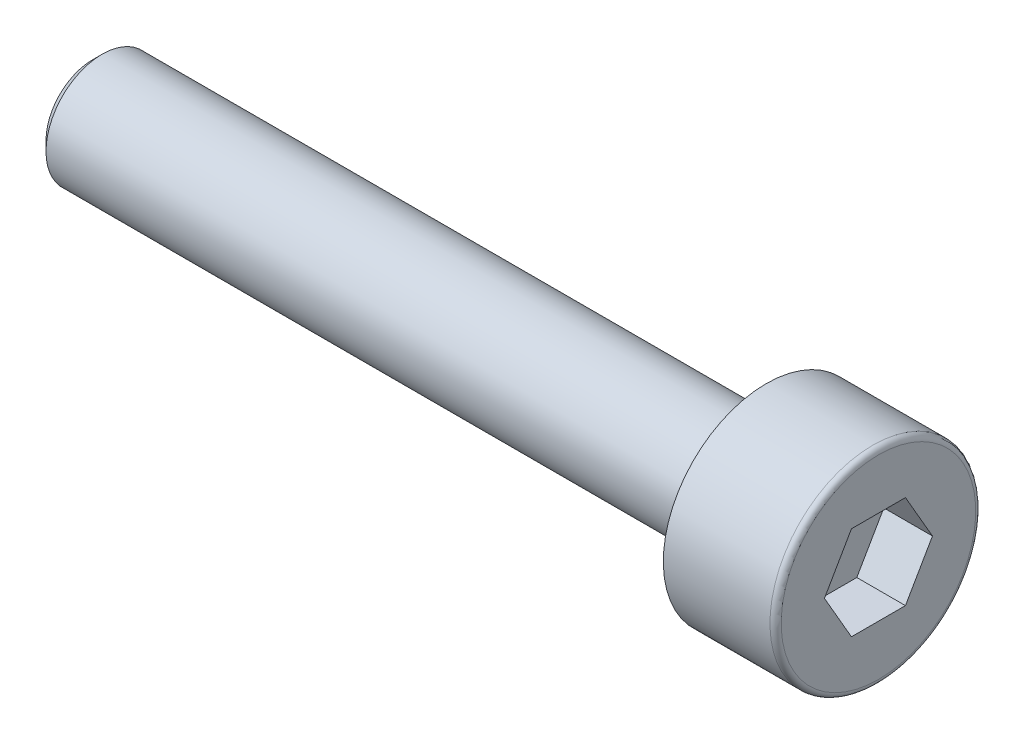
ISO-10303-21;
HEADER;
FILE_DESCRIPTION(('STEP AP214'),'2;1');
FILE_NAME('part.step','',(''),(''),'','','');
FILE_SCHEMA(('AUTOMOTIVE_DESIGN { 1 0 10303 214 1 1 1 1 }'));
ENDSEC;
DATA;
#1=APPLICATION_CONTEXT('core data for automotive mechanical design processes');
#2=APPLICATION_PROTOCOL_DEFINITION('international standard','automotive_design',2000,#1);
#3=PRODUCT_CONTEXT('',#1,'mechanical');
#4=PRODUCT('Part','Part','',(#3));
#5=PRODUCT_RELATED_PRODUCT_CATEGORY('part','',(#4));
#6=PRODUCT_DEFINITION_FORMATION('','',#4);
#7=PRODUCT_DEFINITION_CONTEXT('part definition',#1,'design');
#8=PRODUCT_DEFINITION('design','',#6,#7);
#9=PRODUCT_DEFINITION_SHAPE('','',#8);
#10=(LENGTH_UNIT() NAMED_UNIT(*) SI_UNIT(.MILLI.,.METRE.));
#11=(NAMED_UNIT(*) PLANE_ANGLE_UNIT() SI_UNIT($,.RADIAN.));
#12=(NAMED_UNIT(*) SI_UNIT($,.STERADIAN.) SOLID_ANGLE_UNIT());
#13=UNCERTAINTY_MEASURE_WITH_UNIT(LENGTH_MEASURE(1.E-05),#10,'distance_accuracy_value','');
#14=(GEOMETRIC_REPRESENTATION_CONTEXT(3) GLOBAL_UNCERTAINTY_ASSIGNED_CONTEXT((#13)) GLOBAL_UNIT_ASSIGNED_CONTEXT((#10,
#11,#12)) REPRESENTATION_CONTEXT('',''));
#15=CARTESIAN_POINT('',(0.,0.,0.));
#16=DIRECTION('',(0.,0.,1.));
#17=DIRECTION('',(1.,0.,0.));
#18=AXIS2_PLACEMENT_3D('',#15,#16,#17);
#19=CARTESIAN_POINT('',(0.,0.,0.));
#20=DIRECTION('',(1.,0.,0.));
#21=DIRECTION('',(0.,1.,0.));
#22=AXIS2_PLACEMENT_3D('',#19,#20,#21);
#23=PLANE('',#22);
#24=DIRECTION('',(0.,-0.866025403784439,0.5));
#25=VECTOR('',#24,1.);
#26=CARTESIAN_POINT('',(0.,1.25,0.721687836487035));
#27=LINE('',#26,#25);
#28=CARTESIAN_POINT('',(0.,1.25,0.721687836487035));
#29=VERTEX_POINT('',#28);
#30=CARTESIAN_POINT('',(0.,0.,1.44337567297407));
#31=VERTEX_POINT('',#30);
#32=EDGE_CURVE('E31',#29,#31,#27,.T.);
#33=ORIENTED_EDGE('',*,*,#32,.F.);
#34=DIRECTION('',(0.,0.,1.));
#35=VECTOR('',#34,1.);
#36=CARTESIAN_POINT('',(0.,1.25,-0.721687836487035));
#37=LINE('',#36,#35);
#38=CARTESIAN_POINT('',(0.,1.25,-0.721687836487035));
#39=VERTEX_POINT('',#38);
#40=EDGE_CURVE('E114',#39,#29,#37,.T.);
#41=ORIENTED_EDGE('',*,*,#40,.F.);
#42=DIRECTION('',(0.,0.866025403784439,0.5));
#43=VECTOR('',#42,1.);
#44=CARTESIAN_POINT('',(0.,0.,-1.44337567297406));
#45=LINE('',#44,#43);
#46=CARTESIAN_POINT('',(0.,0.,-1.44337567297406));
#47=VERTEX_POINT('',#46);
#48=EDGE_CURVE('E112',#47,#39,#45,.T.);
#49=ORIENTED_EDGE('',*,*,#48,.F.);
#50=DIRECTION('',(0.,0.866025403784439,-0.5));
#51=VECTOR('',#50,1.);
#52=CARTESIAN_POINT('',(0.,-1.25,-0.721687836487029));
#53=LINE('',#52,#51);
#54=CARTESIAN_POINT('',(0.,-1.25,-0.721687836487029));
#55=VERTEX_POINT('',#54);
#56=EDGE_CURVE('E79',#55,#47,#53,.T.);
#57=ORIENTED_EDGE('',*,*,#56,.F.);
#58=DIRECTION('',(0.,0.,-1.));
#59=VECTOR('',#58,1.);
#60=CARTESIAN_POINT('',(0.,-1.25,0.721687836487035));
#61=LINE('',#60,#59);
#62=CARTESIAN_POINT('',(0.,-1.25,0.721687836487035));
#63=VERTEX_POINT('',#62);
#64=EDGE_CURVE('E108',#63,#55,#61,.T.);
#65=ORIENTED_EDGE('',*,*,#64,.F.);
#66=DIRECTION('',(0.,-0.866025403784439,-0.5));
#67=VECTOR('',#66,1.);
#68=CARTESIAN_POINT('',(0.,0.,1.44337567297407));
#69=LINE('',#68,#67);
#70=EDGE_CURVE('E105',#31,#63,#69,.T.);
#71=ORIENTED_EDGE('',*,*,#70,.F.);
#72=EDGE_LOOP('',(#33,#41,#49,#57,#65,#71));
#73=FACE_BOUND('',#72,.T.);
#74=CARTESIAN_POINT('',(0.,0.,0.));
#75=DIRECTION('',(1.,0.,0.));
#76=DIRECTION('',(0.,1.,0.));
#77=AXIS2_PLACEMENT_3D('',#74,#75,#76);
#78=CIRCLE('',#77,2.6);
#79=CARTESIAN_POINT('',(0.,2.6,0.));
#80=VERTEX_POINT('',#79);
#81=EDGE_CURVE('E132',#80,#80,#78,.T.);
#82=ORIENTED_EDGE('',*,*,#81,.T.);
#83=EDGE_LOOP('',(#82));
#84=FACE_BOUND('',#83,.T.);
#85=ADVANCED_FACE('F16',(#73,#84),#23,.T.);
#86=CARTESIAN_POINT('',(-0.15,0.,0.));
#87=DIRECTION('',(1.,0.,0.));
#88=DIRECTION('',(0.,1.,0.));
#89=AXIS2_PLACEMENT_3D('',#86,#87,#88);
#90=TOROIDAL_SURFACE('',#89,2.6,0.15);
#91=CARTESIAN_POINT('',(-0.15,0.,0.));
#92=DIRECTION('',(1.,0.,0.));
#93=DIRECTION('',(0.,1.,0.));
#94=AXIS2_PLACEMENT_3D('',#91,#92,#93);
#95=CIRCLE('',#94,2.75);
#96=CARTESIAN_POINT('',(-0.15,2.75,0.));
#97=VERTEX_POINT('',#96);
#98=EDGE_CURVE('E129',#97,#97,#95,.T.);
#99=ORIENTED_EDGE('',*,*,#98,.T.);
#100=EDGE_LOOP('',(#99));
#101=FACE_BOUND('',#100,.T.);
#102=ORIENTED_EDGE('',*,*,#81,.F.);
#103=EDGE_LOOP('',(#102));
#104=FACE_BOUND('',#103,.T.);
#105=ADVANCED_FACE('F151',(#101,#104),#90,.T.);
#106=CARTESIAN_POINT('',(0.,0.,0.));
#107=DIRECTION('',(1.,0.,0.));
#108=DIRECTION('',(0.,1.,0.));
#109=AXIS2_PLACEMENT_3D('',#106,#107,#108);
#110=CYLINDRICAL_SURFACE('',#109,2.75);
#111=CARTESIAN_POINT('',(-3.,0.,0.));
#112=DIRECTION('',(1.,0.,0.));
#113=DIRECTION('',(0.,1.,0.));
#114=AXIS2_PLACEMENT_3D('',#111,#112,#113);
#115=CIRCLE('',#114,2.75);
#116=CARTESIAN_POINT('',(-3.,2.75,0.));
#117=VERTEX_POINT('',#116);
#118=EDGE_CURVE('E126',#117,#117,#115,.T.);
#119=ORIENTED_EDGE('',*,*,#118,.T.);
#120=EDGE_LOOP('',(#119));
#121=FACE_BOUND('',#120,.T.);
#122=ORIENTED_EDGE('',*,*,#98,.F.);
#123=EDGE_LOOP('',(#122));
#124=FACE_BOUND('',#123,.T.);
#125=ADVANCED_FACE('F157',(#121,#124),#110,.T.);
#126=CARTESIAN_POINT('',(-3.,2.75,0.));
#127=DIRECTION('',(-1.,0.,0.));
#128=DIRECTION('',(0.,-1.,0.));
#129=AXIS2_PLACEMENT_3D('',#126,#127,#128);
#130=PLANE('',#129);
#131=CARTESIAN_POINT('',(-3.,0.,0.));
#132=DIRECTION('',(1.,0.,0.));
#133=DIRECTION('',(0.,1.,0.));
#134=AXIS2_PLACEMENT_3D('',#131,#132,#133);
#135=CIRCLE('',#134,1.5);
#136=CARTESIAN_POINT('',(-3.,1.5,0.));
#137=VERTEX_POINT('',#136);
#138=EDGE_CURVE('E118',#137,#137,#135,.T.);
#139=ORIENTED_EDGE('',*,*,#138,.T.);
#140=EDGE_LOOP('',(#139));
#141=FACE_BOUND('',#140,.T.);
#142=ORIENTED_EDGE('',*,*,#118,.F.);
#143=EDGE_LOOP('',(#142));
#144=FACE_BOUND('',#143,.T.);
#145=ADVANCED_FACE('F164',(#141,#144),#130,.T.);
#146=CARTESIAN_POINT('',(0.,0.,0.));
#147=DIRECTION('',(1.,0.,0.));
#148=DIRECTION('',(0.,1.,0.));
#149=AXIS2_PLACEMENT_3D('',#146,#147,#148);
#150=CYLINDRICAL_SURFACE('',#149,1.5);
#151=CARTESIAN_POINT('',(-20.75,0.,0.));
#152=DIRECTION('',(-1.,0.,0.));
#153=DIRECTION('',(0.,-1.,0.));
#154=AXIS2_PLACEMENT_3D('',#151,#152,#153);
#155=CIRCLE('',#154,1.5);
#156=CARTESIAN_POINT('',(-20.75,-1.5,0.));
#157=VERTEX_POINT('',#156);
#158=EDGE_CURVE('E24',#157,#157,#155,.F.);
#159=ORIENTED_EDGE('',*,*,#158,.T.);
#160=EDGE_LOOP('',(#159));
#161=FACE_BOUND('',#160,.T.);
#162=ORIENTED_EDGE('',*,*,#138,.F.);
#163=EDGE_LOOP('',(#162));
#164=FACE_BOUND('',#163,.T.);
#165=ADVANCED_FACE('F137',(#161,#164),#150,.T.);
#166=CARTESIAN_POINT('',(-21.,1.5,0.));
#167=DIRECTION('',(-1.,0.,0.));
#168=DIRECTION('',(0.,-1.,0.));
#169=AXIS2_PLACEMENT_3D('',#166,#167,#168);
#170=PLANE('',#169);
#171=CARTESIAN_POINT('',(-21.,0.,0.));
#172=DIRECTION('',(-1.,0.,0.));
#173=DIRECTION('',(0.,-1.,0.));
#174=AXIS2_PLACEMENT_3D('',#171,#172,#173);
#175=CIRCLE('',#174,1.25);
#176=CARTESIAN_POINT('',(-21.,-1.25,0.));
#177=VERTEX_POINT('',#176);
#178=EDGE_CURVE('E11',#177,#177,#175,.T.);
#179=ORIENTED_EDGE('',*,*,#178,.T.);
#180=EDGE_LOOP('',(#179));
#181=FACE_BOUND('',#180,.T.);
#182=ADVANCED_FACE('F171',(#181),#170,.T.);
#183=CARTESIAN_POINT('',(-1.3,1.25,0.721687836487035));
#184=DIRECTION('',(0.,0.5,0.866025403784439));
#185=DIRECTION('',(0.,-0.866025403784439,0.5));
#186=AXIS2_PLACEMENT_3D('',#183,#184,#185);
#187=PLANE('',#186);
#188=ORIENTED_EDGE('',*,*,#32,.T.);
#189=DIRECTION('',(1.,0.,0.));
#190=VECTOR('',#189,1.);
#191=CARTESIAN_POINT('',(-1.3,0.,1.44337567297407));
#192=LINE('',#191,#190);
#193=CARTESIAN_POINT('',(-1.3,0.,1.44337567297407));
#194=VERTEX_POINT('',#193);
#195=EDGE_CURVE('E61',#194,#31,#192,.T.);
#196=ORIENTED_EDGE('',*,*,#195,.F.);
#197=DIRECTION('',(0.,-0.866025403784439,0.5));
#198=VECTOR('',#197,1.);
#199=CARTESIAN_POINT('',(-1.3,1.25,0.721687836487035));
#200=LINE('',#199,#198);
#201=CARTESIAN_POINT('',(-1.3,1.25,0.721687836487035));
#202=VERTEX_POINT('',#201);
#203=EDGE_CURVE('E116',#202,#194,#200,.T.);
#204=ORIENTED_EDGE('',*,*,#203,.F.);
#205=DIRECTION('',(1.,0.,0.));
#206=VECTOR('',#205,1.);
#207=CARTESIAN_POINT('',(-1.3,1.25,0.721687836487035));
#208=LINE('',#207,#206);
#209=EDGE_CURVE('E39',#202,#29,#208,.T.);
#210=ORIENTED_EDGE('',*,*,#209,.T.);
#211=EDGE_LOOP('',(#188,#196,#204,#210));
#212=FACE_BOUND('',#211,.T.);
#213=ADVANCED_FACE('F174',(#212),#187,.F.);
#214=CARTESIAN_POINT('',(-1.3,1.25,-0.721687836487035));
#215=DIRECTION('',(0.,1.,0.));
#216=DIRECTION('',(-1.,0.,0.));
#217=AXIS2_PLACEMENT_3D('',#214,#215,#216);
#218=PLANE('',#217);
#219=ORIENTED_EDGE('',*,*,#40,.T.);
#220=ORIENTED_EDGE('',*,*,#209,.F.);
#221=DIRECTION('',(0.,0.,1.));
#222=VECTOR('',#221,1.);
#223=CARTESIAN_POINT('',(-1.3,1.25,-0.721687836487035));
#224=LINE('',#223,#222);
#225=CARTESIAN_POINT('',(-1.3,1.25,-0.721687836487035));
#226=VERTEX_POINT('',#225);
#227=EDGE_CURVE('E91',#226,#202,#224,.T.);
#228=ORIENTED_EDGE('',*,*,#227,.F.);
#229=DIRECTION('',(1.,0.,0.));
#230=VECTOR('',#229,1.);
#231=CARTESIAN_POINT('',(-1.3,1.25,-0.721687836487035));
#232=LINE('',#231,#230);
#233=EDGE_CURVE('E83',#226,#39,#232,.T.);
#234=ORIENTED_EDGE('',*,*,#233,.T.);
#235=EDGE_LOOP('',(#219,#220,#228,#234));
#236=FACE_BOUND('',#235,.T.);
#237=ADVANCED_FACE('F178',(#236),#218,.F.);
#238=CARTESIAN_POINT('',(-1.3,0.,-1.44337567297406));
#239=DIRECTION('',(0.,0.5,-0.866025403784439));
#240=DIRECTION('',(0.,0.866025403784439,0.5));
#241=AXIS2_PLACEMENT_3D('',#238,#239,#240);
#242=PLANE('',#241);
#243=ORIENTED_EDGE('',*,*,#48,.T.);
#244=ORIENTED_EDGE('',*,*,#233,.F.);
#245=DIRECTION('',(0.,0.866025403784439,0.5));
#246=VECTOR('',#245,1.);
#247=CARTESIAN_POINT('',(-1.3,0.,-1.44337567297406));
#248=LINE('',#247,#246);
#249=CARTESIAN_POINT('',(-1.3,0.,-1.44337567297406));
#250=VERTEX_POINT('',#249);
#251=EDGE_CURVE('E87',#250,#226,#248,.T.);
#252=ORIENTED_EDGE('',*,*,#251,.F.);
#253=DIRECTION('',(1.,0.,0.));
#254=VECTOR('',#253,1.);
#255=CARTESIAN_POINT('',(-1.3,0.,-1.44337567297406));
#256=LINE('',#255,#254);
#257=EDGE_CURVE('E72',#250,#47,#256,.T.);
#258=ORIENTED_EDGE('',*,*,#257,.T.);
#259=EDGE_LOOP('',(#243,#244,#252,#258));
#260=FACE_BOUND('',#259,.T.);
#261=ADVANCED_FACE('F88',(#260),#242,.F.);
#262=CARTESIAN_POINT('',(-1.3,-1.25,-0.721687836487029));
#263=DIRECTION('',(0.,-0.5,-0.866025403784439));
#264=DIRECTION('',(0.,0.866025403784439,-0.5));
#265=AXIS2_PLACEMENT_3D('',#262,#263,#264);
#266=PLANE('',#265);
#267=ORIENTED_EDGE('',*,*,#56,.T.);
#268=ORIENTED_EDGE('',*,*,#257,.F.);
#269=DIRECTION('',(0.,0.866025403784439,-0.5));
#270=VECTOR('',#269,1.);
#271=CARTESIAN_POINT('',(-1.3,-1.25,-0.721687836487029));
#272=LINE('',#271,#270);
#273=CARTESIAN_POINT('',(-1.3,-1.25,-0.721687836487029));
#274=VERTEX_POINT('',#273);
#275=EDGE_CURVE('E76',#274,#250,#272,.T.);
#276=ORIENTED_EDGE('',*,*,#275,.F.);
#277=DIRECTION('',(1.,0.,0.));
#278=VECTOR('',#277,1.);
#279=CARTESIAN_POINT('',(-1.3,-1.25,-0.721687836487029));
#280=LINE('',#279,#278);
#281=EDGE_CURVE('E84',#274,#55,#280,.T.);
#282=ORIENTED_EDGE('',*,*,#281,.T.);
#283=EDGE_LOOP('',(#267,#268,#276,#282));
#284=FACE_BOUND('',#283,.T.);
#285=ADVANCED_FACE('F74',(#284),#266,.F.);
#286=CARTESIAN_POINT('',(-1.3,-1.25,0.721687836487035));
#287=DIRECTION('',(0.,-1.,0.));
#288=DIRECTION('',(0.,0.,-1.));
#289=AXIS2_PLACEMENT_3D('',#286,#287,#288);
#290=PLANE('',#289);
#291=ORIENTED_EDGE('',*,*,#64,.T.);
#292=ORIENTED_EDGE('',*,*,#281,.F.);
#293=DIRECTION('',(0.,0.,-1.));
#294=VECTOR('',#293,1.);
#295=CARTESIAN_POINT('',(-1.3,-1.25,0.721687836487035));
#296=LINE('',#295,#294);
#297=CARTESIAN_POINT('',(-1.3,-1.25,0.721687836487035));
#298=VERTEX_POINT('',#297);
#299=EDGE_CURVE('E97',#298,#274,#296,.T.);
#300=ORIENTED_EDGE('',*,*,#299,.F.);
#301=DIRECTION('',(1.,0.,0.));
#302=VECTOR('',#301,1.);
#303=CARTESIAN_POINT('',(-1.3,-1.25,0.721687836487035));
#304=LINE('',#303,#302);
#305=EDGE_CURVE('E121',#298,#63,#304,.T.);
#306=ORIENTED_EDGE('',*,*,#305,.T.);
#307=EDGE_LOOP('',(#291,#292,#300,#306));
#308=FACE_BOUND('',#307,.T.);
#309=ADVANCED_FACE('F181',(#308),#290,.F.);
#310=CARTESIAN_POINT('',(-1.3,0.,1.44337567297407));
#311=DIRECTION('',(0.,-0.5,0.866025403784439));
#312=DIRECTION('',(0.,-0.866025403784439,-0.5));
#313=AXIS2_PLACEMENT_3D('',#310,#311,#312);
#314=PLANE('',#313);
#315=ORIENTED_EDGE('',*,*,#70,.T.);
#316=ORIENTED_EDGE('',*,*,#305,.F.);
#317=DIRECTION('',(0.,-0.866025403784439,-0.5));
#318=VECTOR('',#317,1.);
#319=CARTESIAN_POINT('',(-1.3,0.,1.44337567297407));
#320=LINE('',#319,#318);
#321=EDGE_CURVE('E99',#194,#298,#320,.T.);
#322=ORIENTED_EDGE('',*,*,#321,.F.);
#323=ORIENTED_EDGE('',*,*,#195,.T.);
#324=EDGE_LOOP('',(#315,#316,#322,#323));
#325=FACE_BOUND('',#324,.T.);
#326=ADVANCED_FACE('F147',(#325),#314,.F.);
#327=CARTESIAN_POINT('',(-1.3,0.,1.44337567297407));
#328=DIRECTION('',(1.,0.,0.));
#329=DIRECTION('',(0.,1.,0.));
#330=AXIS2_PLACEMENT_3D('',#327,#328,#329);
#331=PLANE('',#330);
#332=ORIENTED_EDGE('',*,*,#203,.T.);
#333=ORIENTED_EDGE('',*,*,#321,.T.);
#334=ORIENTED_EDGE('',*,*,#299,.T.);
#335=ORIENTED_EDGE('',*,*,#275,.T.);
#336=ORIENTED_EDGE('',*,*,#251,.T.);
#337=ORIENTED_EDGE('',*,*,#227,.T.);
#338=EDGE_LOOP('',(#332,#333,#334,#335,#336,#337));
#339=FACE_BOUND('',#338,.T.);
#340=ADVANCED_FACE('F94',(#339),#331,.T.);
#341=CARTESIAN_POINT('',(-20.75,0.,0.));
#342=DIRECTION('',(1.,0.,0.));
#343=DIRECTION('',(0.,1.,0.));
#344=AXIS2_PLACEMENT_3D('',#341,#342,#343);
#345=CONICAL_SURFACE('',#344,1.5,0.785398163397442);
#346=ORIENTED_EDGE('',*,*,#178,.F.);
#347=EDGE_LOOP('',(#346));
#348=FACE_BOUND('',#347,.T.);
#349=ORIENTED_EDGE('',*,*,#158,.F.);
#350=EDGE_LOOP('',(#349));
#351=FACE_BOUND('',#350,.T.);
#352=ADVANCED_FACE('F18',(#348,#351),#345,.T.);
#353=CLOSED_SHELL('',(#85,#105,#125,#145,#165,#182,#213,#237,#261,#285,#309,#326,#340,#352));
#354=MANIFOLD_SOLID_BREP('B1',#353);
#355=ADVANCED_BREP_SHAPE_REPRESENTATION('',(#18,#354),#14);
#356=SHAPE_DEFINITION_REPRESENTATION(#9,#355);
ENDSEC;
END-ISO-10303-21;
